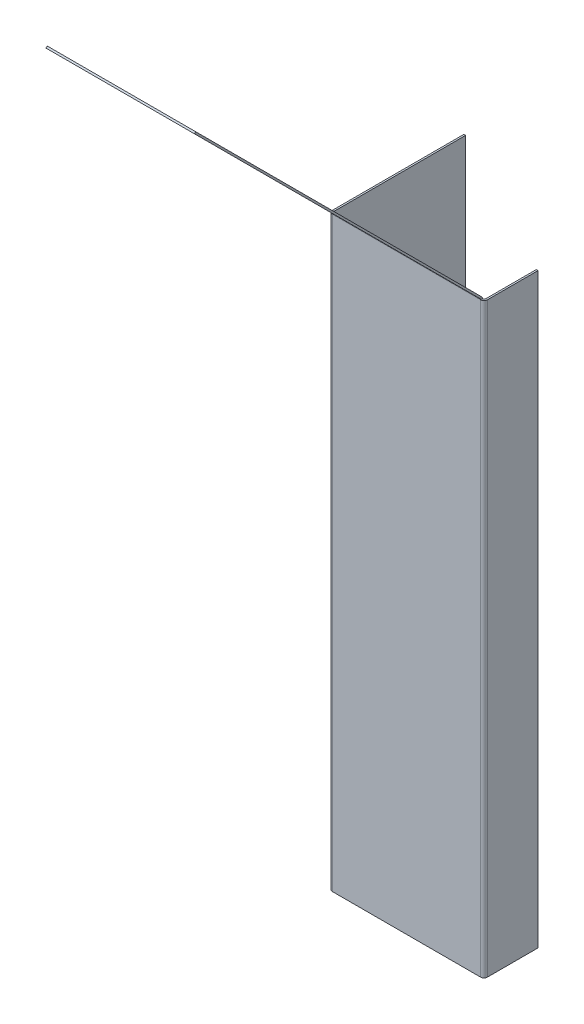
ISO-10303-21;
HEADER;
FILE_DESCRIPTION(('STEP AP214'),'2;1');
FILE_NAME('part.step','',(''),(''),'','','');
FILE_SCHEMA(('AUTOMOTIVE_DESIGN { 1 0 10303 214 1 1 1 1 }'));
ENDSEC;
DATA;
#1=APPLICATION_CONTEXT('core data for automotive mechanical design processes');
#2=APPLICATION_PROTOCOL_DEFINITION('international standard','automotive_design',2000,#1);
#3=PRODUCT_CONTEXT('',#1,'mechanical');
#4=PRODUCT('Part','Part','',(#3));
#5=PRODUCT_RELATED_PRODUCT_CATEGORY('part','',(#4));
#6=PRODUCT_DEFINITION_FORMATION('','',#4);
#7=PRODUCT_DEFINITION_CONTEXT('part definition',#1,'design');
#8=PRODUCT_DEFINITION('design','',#6,#7);
#9=PRODUCT_DEFINITION_SHAPE('','',#8);
#10=(LENGTH_UNIT() NAMED_UNIT(*) SI_UNIT(.MILLI.,.METRE.));
#11=(NAMED_UNIT(*) PLANE_ANGLE_UNIT() SI_UNIT($,.RADIAN.));
#12=(NAMED_UNIT(*) SI_UNIT($,.STERADIAN.) SOLID_ANGLE_UNIT());
#13=UNCERTAINTY_MEASURE_WITH_UNIT(LENGTH_MEASURE(1.E-05),#10,'distance_accuracy_value','');
#14=(GEOMETRIC_REPRESENTATION_CONTEXT(3) GLOBAL_UNCERTAINTY_ASSIGNED_CONTEXT((#13)) GLOBAL_UNIT_ASSIGNED_CONTEXT((#10,
#11,#12)) REPRESENTATION_CONTEXT('',''));
#15=CARTESIAN_POINT('',(0.,0.,0.));
#16=DIRECTION('',(0.,0.,1.));
#17=DIRECTION('',(1.,0.,0.));
#18=AXIS2_PLACEMENT_3D('',#15,#16,#17);
#19=CARTESIAN_POINT('',(-1.54940000000022,0.,-63.5));
#20=DIRECTION('',(0.,0.,1.));
#21=DIRECTION('',(1.,0.,0.));
#22=AXIS2_PLACEMENT_3D('',#19,#20,#21);
#23=PLANE('',#22);
#24=DIRECTION('',(0.,1.,0.));
#25=VECTOR('',#24,1.);
#26=CARTESIAN_POINT('',(-0.736600000000216,0.,-63.5));
#27=LINE('',#26,#25);
#28=CARTESIAN_POINT('',(-0.736600000000216,276.046890289956,-63.5));
#29=VERTEX_POINT('',#28);
#30=CARTESIAN_POINT('',(-0.736600000000216,130.175,-63.5));
#31=VERTEX_POINT('',#30);
#32=EDGE_CURVE('E325',#29,#31,#27,.F.);
#33=ORIENTED_EDGE('',*,*,#32,.T.);
#34=DIRECTION('',(-1.,0.,0.));
#35=VECTOR('',#34,1.);
#36=CARTESIAN_POINT('',(71.4004000000001,130.175,-63.5000000000002));
#37=LINE('',#36,#35);
#38=CARTESIAN_POINT('',(-1.54940000000022,130.175,-63.5));
#39=VERTEX_POINT('',#38);
#40=EDGE_CURVE('E344',#31,#39,#37,.T.);
#41=ORIENTED_EDGE('',*,*,#40,.T.);
#42=DIRECTION('',(0.,-1.,0.));
#43=VECTOR('',#42,1.);
#44=CARTESIAN_POINT('',(-1.54940000000022,0.,-63.5));
#45=LINE('',#44,#43);
#46=CARTESIAN_POINT('',(-1.54940000000022,276.046890289956,-63.5));
#47=VERTEX_POINT('',#46);
#48=EDGE_CURVE('E335',#47,#39,#45,.T.);
#49=ORIENTED_EDGE('',*,*,#48,.F.);
#50=DIRECTION('',(1.,0.,0.));
#51=VECTOR('',#50,1.);
#52=CARTESIAN_POINT('',(-1.54940000000022,276.046890289956,-63.5));
#53=LINE('',#52,#51);
#54=EDGE_CURVE('E298',#47,#29,#53,.T.);
#55=ORIENTED_EDGE('',*,*,#54,.T.);
#56=EDGE_LOOP('',(#33,#41,#49,#55));
#57=FACE_BOUND('',#56,.T.);
#58=ADVANCED_FACE('F79',(#57),#23,.F.);
#59=CARTESIAN_POINT('',(69.85,276.567745144978,0.215745144978014));
#60=DIRECTION('',(1.,0.,0.));
#61=DIRECTION('',(0.,0.,-1.));
#62=AXIS2_PLACEMENT_3D('',#59,#60,#61);
#63=PLANE('',#62);
#64=DIRECTION('',(0.,0.707106781186553,-0.707106781186542));
#65=VECTOR('',#64,1.);
#66=CARTESIAN_POINT('',(69.85,276.567745144978,0.215745144978014));
#67=LINE('',#66,#65);
#68=CARTESIAN_POINT('',(69.85,276.567745144978,0.215745144978014));
#69=VERTEX_POINT('',#68);
#70=CARTESIAN_POINT('',(69.85,277.142481536726,-0.358991246770408));
#71=VERTEX_POINT('',#70);
#72=EDGE_CURVE('E13',#69,#71,#67,.T.);
#73=ORIENTED_EDGE('',*,*,#72,.F.);
#74=CARTESIAN_POINT('',(69.85,276.046890289956,0.736600000000009));
#75=DIRECTION('',(-1.,0.,0.));
#76=DIRECTION('',(0.,0.,1.));
#77=AXIS2_PLACEMENT_3D('',#74,#75,#76);
#78=CIRCLE('',#77,0.7366);
#79=CARTESIAN_POINT('',(69.85,276.046890289956,0.));
#80=VERTEX_POINT('',#79);
#81=EDGE_CURVE('E150',#80,#69,#78,.F.);
#82=ORIENTED_EDGE('',*,*,#81,.F.);
#83=DIRECTION('',(0.,0.,1.));
#84=VECTOR('',#83,1.);
#85=CARTESIAN_POINT('',(69.85,276.046890289956,-0.812799999999991));
#86=LINE('',#85,#84);
#87=CARTESIAN_POINT('',(69.85,276.046890289956,-0.812799999999978));
#88=VERTEX_POINT('',#87);
#89=EDGE_CURVE('E87',#88,#80,#86,.T.);
#90=ORIENTED_EDGE('',*,*,#89,.F.);
#91=CARTESIAN_POINT('',(69.85,276.046890289956,0.736600000000009));
#92=DIRECTION('',(1.,0.,0.));
#93=DIRECTION('',(0.,0.,-1.));
#94=AXIS2_PLACEMENT_3D('',#91,#92,#93);
#95=CIRCLE('',#94,1.5494);
#96=EDGE_CURVE('E153',#88,#71,#95,.T.);
#97=ORIENTED_EDGE('',*,*,#96,.T.);
#98=EDGE_LOOP('',(#73,#82,#90,#97));
#99=FACE_BOUND('',#98,.T.);
#100=ADVANCED_FACE('F81',(#99),#63,.T.);
#101=CARTESIAN_POINT('',(69.85,276.046890289956,-0.812799999999991));
#102=DIRECTION('',(1.,0.,0.));
#103=DIRECTION('',(0.,0.,-1.));
#104=AXIS2_PLACEMENT_3D('',#101,#102,#103);
#105=PLANE('',#104);
#106=DIRECTION('',(0.,0.707106781186546,0.707106781186549));
#107=VECTOR('',#106,1.);
#108=CARTESIAN_POINT('',(69.85,276.352,0.));
#109=LINE('',#108,#107);
#110=CARTESIAN_POINT('',(69.85,411.055841816037,134.703841816038));
#111=VERTEX_POINT('',#110);
#112=EDGE_CURVE('E161',#69,#111,#109,.T.);
#113=ORIENTED_EDGE('',*,*,#112,.F.);
#114=ORIENTED_EDGE('',*,*,#72,.T.);
#115=DIRECTION('',(0.,0.707106781186546,0.707106781186549));
#116=VECTOR('',#115,1.);
#117=CARTESIAN_POINT('',(69.85,276.926736391748,-0.574736391748425));
#118=LINE('',#117,#116);
#119=CARTESIAN_POINT('',(69.85,411.630578207786,134.129105424289));
#120=VERTEX_POINT('',#119);
#121=EDGE_CURVE('E138',#71,#120,#118,.T.);
#122=ORIENTED_EDGE('',*,*,#121,.T.);
#123=DIRECTION('',(0.,0.707106781186548,-0.707106781186548));
#124=VECTOR('',#123,1.);
#125=CARTESIAN_POINT('',(69.85,411.055841816037,134.703841816038));
#126=LINE('',#125,#124);
#127=EDGE_CURVE('E171',#111,#120,#126,.T.);
#128=ORIENTED_EDGE('',*,*,#127,.F.);
#129=EDGE_LOOP('',(#113,#114,#122,#128));
#130=FACE_BOUND('',#129,.T.);
#131=ADVANCED_FACE('F169',(#130),#105,.T.);
#132=CARTESIAN_POINT('',(0.,276.046890289956,0.));
#133=DIRECTION('',(-1.,0.,0.));
#134=DIRECTION('',(0.,0.,1.));
#135=AXIS2_PLACEMENT_3D('',#132,#133,#134);
#136=PLANE('',#135);
#137=DIRECTION('',(0.,0.,-1.));
#138=VECTOR('',#137,1.);
#139=CARTESIAN_POINT('',(0.,276.046890289956,0.));
#140=LINE('',#139,#138);
#141=CARTESIAN_POINT('',(0.,276.046890289956,0.));
#142=VERTEX_POINT('',#141);
#143=CARTESIAN_POINT('',(0.,276.046890289956,-0.812799999999991));
#144=VERTEX_POINT('',#143);
#145=EDGE_CURVE('E223',#142,#144,#140,.T.);
#146=ORIENTED_EDGE('',*,*,#145,.F.);
#147=CARTESIAN_POINT('',(0.,276.046890289956,0.736600000000009));
#148=DIRECTION('',(-1.,0.,0.));
#149=DIRECTION('',(0.,0.,1.));
#150=AXIS2_PLACEMENT_3D('',#147,#148,#149);
#151=CIRCLE('',#150,0.7366);
#152=CARTESIAN_POINT('',(0.,276.567745144978,0.215745144978014));
#153=VERTEX_POINT('',#152);
#154=EDGE_CURVE('E197',#142,#153,#151,.F.);
#155=ORIENTED_EDGE('',*,*,#154,.T.);
#156=DIRECTION('',(0.,-0.707106781186553,0.707106781186542));
#157=VECTOR('',#156,1.);
#158=CARTESIAN_POINT('',(0.,277.142481536726,-0.358991246770408));
#159=LINE('',#158,#157);
#160=CARTESIAN_POINT('',(0.,277.142481536726,-0.358991246770408));
#161=VERTEX_POINT('',#160);
#162=EDGE_CURVE('E132',#161,#153,#159,.T.);
#163=ORIENTED_EDGE('',*,*,#162,.F.);
#164=CARTESIAN_POINT('',(0.,276.046890289956,0.736600000000009));
#165=DIRECTION('',(1.,0.,0.));
#166=DIRECTION('',(0.,0.,-1.));
#167=AXIS2_PLACEMENT_3D('',#164,#165,#166);
#168=CIRCLE('',#167,1.5494);
#169=EDGE_CURVE('E207',#144,#161,#168,.T.);
#170=ORIENTED_EDGE('',*,*,#169,.F.);
#171=EDGE_LOOP('',(#146,#155,#163,#170));
#172=FACE_BOUND('',#171,.T.);
#173=ADVANCED_FACE('F573',(#172),#136,.T.);
#174=CARTESIAN_POINT('',(69.85,276.926736391748,-0.574736391748425));
#175=DIRECTION('',(0.,-0.707106781186549,0.707106781186546));
#176=DIRECTION('',(0.,-0.707106781186546,-0.707106781186549));
#177=AXIS2_PLACEMENT_3D('',#174,#175,#176);
#178=PLANE('',#177);
#179=DIRECTION('',(0.,0.707106781186546,0.707106781186549));
#180=VECTOR('',#179,1.);
#181=CARTESIAN_POINT('',(0.,276.926736391748,-0.574736391748425));
#182=LINE('',#181,#180);
#183=CARTESIAN_POINT('',(0.,411.630578207786,134.129105424289));
#184=VERTEX_POINT('',#183);
#185=EDGE_CURVE('E189',#161,#184,#182,.T.);
#186=ORIENTED_EDGE('',*,*,#185,.T.);
#187=DIRECTION('',(-1.,0.,0.));
#188=VECTOR('',#187,1.);
#189=CARTESIAN_POINT('',(69.85,411.630578207786,134.129105424289));
#190=LINE('',#189,#188);
#191=EDGE_CURVE('E220',#120,#184,#190,.T.);
#192=ORIENTED_EDGE('',*,*,#191,.F.);
#193=ORIENTED_EDGE('',*,*,#121,.F.);
#194=DIRECTION('',(-1.,0.,0.));
#195=VECTOR('',#194,1.);
#196=CARTESIAN_POINT('',(69.85,277.142481536726,-0.358991246770408));
#197=LINE('',#196,#195);
#198=EDGE_CURVE('E188',#71,#161,#197,.T.);
#199=ORIENTED_EDGE('',*,*,#198,.T.);
#200=EDGE_LOOP('',(#186,#192,#193,#199));
#201=FACE_BOUND('',#200,.T.);
#202=ADVANCED_FACE('F247',(#201),#178,.F.);
#203=CARTESIAN_POINT('',(69.85,411.055841816037,134.703841816038));
#204=DIRECTION('',(0.,0.707106781186548,0.707106781186548));
#205=DIRECTION('',(0.,-0.707106781186548,0.707106781186548));
#206=AXIS2_PLACEMENT_3D('',#203,#204,#205);
#207=PLANE('',#206);
#208=DIRECTION('',(0.,0.707106781186548,-0.707106781186548));
#209=VECTOR('',#208,1.);
#210=CARTESIAN_POINT('',(0.,411.055841816037,134.703841816038));
#211=LINE('',#210,#209);
#212=CARTESIAN_POINT('',(0.,411.055841816037,134.703841816038));
#213=VERTEX_POINT('',#212);
#214=EDGE_CURVE('E192',#213,#184,#211,.T.);
#215=ORIENTED_EDGE('',*,*,#214,.F.);
#216=DIRECTION('',(-1.,0.,0.));
#217=VECTOR('',#216,1.);
#218=CARTESIAN_POINT('',(69.85,411.055841816037,134.703841816038));
#219=LINE('',#218,#217);
#220=EDGE_CURVE('E166',#111,#213,#219,.T.);
#221=ORIENTED_EDGE('',*,*,#220,.F.);
#222=ORIENTED_EDGE('',*,*,#127,.T.);
#223=ORIENTED_EDGE('',*,*,#191,.T.);
#224=EDGE_LOOP('',(#215,#221,#222,#223));
#225=FACE_BOUND('',#224,.T.);
#226=ADVANCED_FACE('F567',(#225),#207,.T.);
#227=CARTESIAN_POINT('',(69.85,276.352,0.));
#228=DIRECTION('',(0.,-0.707106781186549,0.707106781186546));
#229=DIRECTION('',(0.,-0.707106781186546,-0.707106781186549));
#230=AXIS2_PLACEMENT_3D('',#227,#228,#229);
#231=PLANE('',#230);
#232=DIRECTION('',(0.,0.707106781186546,0.707106781186549));
#233=VECTOR('',#232,1.);
#234=CARTESIAN_POINT('',(0.,276.352,0.));
#235=LINE('',#234,#233);
#236=EDGE_CURVE('E163',#153,#213,#235,.T.);
#237=ORIENTED_EDGE('',*,*,#236,.F.);
#238=DIRECTION('',(-1.,0.,0.));
#239=VECTOR('',#238,1.);
#240=CARTESIAN_POINT('',(69.85,276.567745144978,0.215745144978014));
#241=LINE('',#240,#239);
#242=EDGE_CURVE('E159',#69,#153,#241,.T.);
#243=ORIENTED_EDGE('',*,*,#242,.F.);
#244=ORIENTED_EDGE('',*,*,#112,.T.);
#245=ORIENTED_EDGE('',*,*,#220,.T.);
#246=EDGE_LOOP('',(#237,#243,#244,#245));
#247=FACE_BOUND('',#246,.T.);
#248=ADVANCED_FACE('F160',(#247),#231,.T.);
#249=CARTESIAN_POINT('',(69.85,276.046890289956,0.736600000000009));
#250=DIRECTION('',(-1.,0.,0.));
#251=DIRECTION('',(0.,0.,1.));
#252=AXIS2_PLACEMENT_3D('',#249,#250,#251);
#253=CYLINDRICAL_SURFACE('',#252,0.7366);
#254=ORIENTED_EDGE('',*,*,#154,.F.);
#255=DIRECTION('',(-1.,0.,0.));
#256=VECTOR('',#255,1.);
#257=CARTESIAN_POINT('',(69.85,276.046890289956,0.));
#258=LINE('',#257,#256);
#259=EDGE_CURVE('E167',#80,#142,#258,.T.);
#260=ORIENTED_EDGE('',*,*,#259,.F.);
#261=ORIENTED_EDGE('',*,*,#81,.T.);
#262=ORIENTED_EDGE('',*,*,#242,.T.);
#263=EDGE_LOOP('',(#254,#260,#261,#262));
#264=FACE_BOUND('',#263,.T.);
#265=ADVANCED_FACE('F174',(#264),#253,.F.);
#266=CARTESIAN_POINT('',(69.85,0.,0.));
#267=DIRECTION('',(0.,0.,1.));
#268=DIRECTION('',(1.,0.,0.));
#269=AXIS2_PLACEMENT_3D('',#266,#267,#268);
#270=PLANE('',#269);
#271=DIRECTION('',(0.,1.,0.));
#272=VECTOR('',#271,1.);
#273=CARTESIAN_POINT('',(0.,0.,0.));
#274=LINE('',#273,#272);
#275=CARTESIAN_POINT('',(0.,0.,0.));
#276=VERTEX_POINT('',#275);
#277=EDGE_CURVE('E199',#276,#142,#274,.T.);
#278=ORIENTED_EDGE('',*,*,#277,.F.);
#279=DIRECTION('',(-1.,0.,0.));
#280=VECTOR('',#279,1.);
#281=CARTESIAN_POINT('',(69.85,0.,0.));
#282=LINE('',#281,#280);
#283=CARTESIAN_POINT('',(69.85,0.,0.));
#284=VERTEX_POINT('',#283);
#285=EDGE_CURVE('E216',#284,#276,#282,.T.);
#286=ORIENTED_EDGE('',*,*,#285,.F.);
#287=DIRECTION('',(0.,1.,0.));
#288=VECTOR('',#287,1.);
#289=CARTESIAN_POINT('',(69.85,0.,0.));
#290=LINE('',#289,#288);
#291=EDGE_CURVE('E176',#284,#80,#290,.T.);
#292=ORIENTED_EDGE('',*,*,#291,.T.);
#293=ORIENTED_EDGE('',*,*,#259,.T.);
#294=EDGE_LOOP('',(#278,#286,#292,#293));
#295=FACE_BOUND('',#294,.T.);
#296=ADVANCED_FACE('F468',(#295),#270,.T.);
#297=CARTESIAN_POINT('',(69.85,0.,-0.8128));
#298=DIRECTION('',(0.,-1.,0.));
#299=DIRECTION('',(0.,0.,-1.));
#300=AXIS2_PLACEMENT_3D('',#297,#298,#299);
#301=PLANE('',#300);
#302=DIRECTION('',(0.,0.,1.));
#303=VECTOR('',#302,1.);
#304=CARTESIAN_POINT('',(0.,0.,-0.8128));
#305=LINE('',#304,#303);
#306=CARTESIAN_POINT('',(0.,0.,-0.8128));
#307=VERTEX_POINT('',#306);
#308=EDGE_CURVE('E202',#307,#276,#305,.T.);
#309=ORIENTED_EDGE('',*,*,#308,.F.);
#310=DIRECTION('',(-1.,0.,0.));
#311=VECTOR('',#310,1.);
#312=CARTESIAN_POINT('',(69.85,0.,-0.8128));
#313=LINE('',#312,#311);
#314=CARTESIAN_POINT('',(69.85,0.,-0.812800000000018));
#315=VERTEX_POINT('',#314);
#316=EDGE_CURVE('E214',#315,#307,#313,.T.);
#317=ORIENTED_EDGE('',*,*,#316,.F.);
#318=DIRECTION('',(0.,0.,1.));
#319=VECTOR('',#318,1.);
#320=CARTESIAN_POINT('',(69.85,0.,-0.8128));
#321=LINE('',#320,#319);
#322=EDGE_CURVE('E178',#315,#284,#321,.T.);
#323=ORIENTED_EDGE('',*,*,#322,.T.);
#324=ORIENTED_EDGE('',*,*,#285,.T.);
#325=EDGE_LOOP('',(#309,#317,#323,#324));
#326=FACE_BOUND('',#325,.T.);
#327=ADVANCED_FACE('F471',(#326),#301,.T.);
#328=CARTESIAN_POINT('',(69.85,0.,-0.8128));
#329=DIRECTION('',(0.,0.,1.));
#330=DIRECTION('',(1.,0.,0.));
#331=AXIS2_PLACEMENT_3D('',#328,#329,#330);
#332=PLANE('',#331);
#333=DIRECTION('',(0.,1.,0.));
#334=VECTOR('',#333,1.);
#335=CARTESIAN_POINT('',(0.,0.,-0.8128));
#336=LINE('',#335,#334);
#337=EDGE_CURVE('E205',#307,#144,#336,.T.);
#338=ORIENTED_EDGE('',*,*,#337,.T.);
#339=DIRECTION('',(-1.,0.,0.));
#340=VECTOR('',#339,1.);
#341=CARTESIAN_POINT('',(69.85,276.046890289956,-0.812799999999991));
#342=LINE('',#341,#340);
#343=EDGE_CURVE('E211',#88,#144,#342,.T.);
#344=ORIENTED_EDGE('',*,*,#343,.F.);
#345=DIRECTION('',(0.,1.,0.));
#346=VECTOR('',#345,1.);
#347=CARTESIAN_POINT('',(69.85,0.,-0.8128));
#348=LINE('',#347,#346);
#349=EDGE_CURVE('E184',#315,#88,#348,.T.);
#350=ORIENTED_EDGE('',*,*,#349,.F.);
#351=ORIENTED_EDGE('',*,*,#316,.T.);
#352=EDGE_LOOP('',(#338,#344,#350,#351));
#353=FACE_BOUND('',#352,.T.);
#354=ADVANCED_FACE('F241',(#353),#332,.F.);
#355=CARTESIAN_POINT('',(69.85,276.046890289956,0.736600000000009));
#356=DIRECTION('',(-1.,0.,0.));
#357=DIRECTION('',(0.,0.,1.));
#358=AXIS2_PLACEMENT_3D('',#355,#356,#357);
#359=CYLINDRICAL_SURFACE('',#358,1.5494);
#360=ORIENTED_EDGE('',*,*,#169,.T.);
#361=ORIENTED_EDGE('',*,*,#198,.F.);
#362=ORIENTED_EDGE('',*,*,#96,.F.);
#363=ORIENTED_EDGE('',*,*,#343,.T.);
#364=EDGE_LOOP('',(#360,#361,#362,#363));
#365=FACE_BOUND('',#364,.T.);
#366=ADVANCED_FACE('F244',(#365),#359,.T.);
#367=CARTESIAN_POINT('',(0.,276.046890289956,0.736600000000009));
#368=DIRECTION('',(-1.,0.,0.));
#369=DIRECTION('',(0.,0.,1.));
#370=AXIS2_PLACEMENT_3D('',#367,#368,#369);
#371=PLANE('',#370);
#372=ORIENTED_EDGE('',*,*,#185,.F.);
#373=ORIENTED_EDGE('',*,*,#162,.T.);
#374=ORIENTED_EDGE('',*,*,#236,.T.);
#375=ORIENTED_EDGE('',*,*,#214,.T.);
#376=EDGE_LOOP('',(#372,#373,#374,#375));
#377=FACE_BOUND('',#376,.T.);
#378=ADVANCED_FACE('F549',(#377),#371,.T.);
#379=CARTESIAN_POINT('',(69.85,276.046890289956,-1.54939999999998));
#380=DIRECTION('',(0.,1.,0.));
#381=DIRECTION('',(0.,0.,1.));
#382=AXIS2_PLACEMENT_3D('',#379,#380,#381);
#383=PLANE('',#382);
#384=DIRECTION('',(-1.,0.,0.));
#385=VECTOR('',#384,1.);
#386=CARTESIAN_POINT('',(71.3994,276.046890289956,-1.54939999999999));
#387=LINE('',#386,#385);
#388=CARTESIAN_POINT('',(70.5866,276.046890289956,-1.54939999999998));
#389=VERTEX_POINT('',#388);
#390=CARTESIAN_POINT('',(71.3994,276.046890289956,-1.54939999999998));
#391=VERTEX_POINT('',#390);
#392=EDGE_CURVE('E259',#389,#391,#387,.F.);
#393=ORIENTED_EDGE('',*,*,#392,.F.);
#394=CARTESIAN_POINT('',(69.85,276.046890289956,-1.54939999999998));
#395=DIRECTION('',(0.,-1.,0.));
#396=DIRECTION('',(0.,0.,-1.));
#397=AXIS2_PLACEMENT_3D('',#394,#395,#396);
#398=CIRCLE('',#397,0.736600000000004);
#399=EDGE_CURVE('E235',#88,#389,#398,.F.);
#400=ORIENTED_EDGE('',*,*,#399,.F.);
#401=ORIENTED_EDGE('',*,*,#89,.T.);
#402=CARTESIAN_POINT('',(69.85,276.046890289956,-1.54939999999998));
#403=DIRECTION('',(0.,-1.,0.));
#404=DIRECTION('',(0.,0.,-1.));
#405=AXIS2_PLACEMENT_3D('',#402,#403,#404);
#406=CIRCLE('',#405,1.5494);
#407=EDGE_CURVE('E193',#80,#391,#406,.F.);
#408=ORIENTED_EDGE('',*,*,#407,.T.);
#409=EDGE_LOOP('',(#393,#400,#401,#408));
#410=FACE_BOUND('',#409,.T.);
#411=ADVANCED_FACE('F230',(#410),#383,.T.);
#412=CARTESIAN_POINT('',(69.85,0.,-1.54940000000002));
#413=DIRECTION('',(0.,1.,0.));
#414=DIRECTION('',(0.,0.,1.));
#415=AXIS2_PLACEMENT_3D('',#412,#413,#414);
#416=PLANE('',#415);
#417=CARTESIAN_POINT('',(69.85,0.,-1.54940000000002));
#418=DIRECTION('',(0.,-1.,0.));
#419=DIRECTION('',(0.,0.,-1.));
#420=AXIS2_PLACEMENT_3D('',#417,#418,#419);
#421=CIRCLE('',#420,0.736600000000004);
#422=CARTESIAN_POINT('',(70.5866,0.,-1.54940000000002));
#423=VERTEX_POINT('',#422);
#424=EDGE_CURVE('E250',#423,#315,#421,.T.);
#425=ORIENTED_EDGE('',*,*,#424,.F.);
#426=DIRECTION('',(-1.,0.,0.));
#427=VECTOR('',#426,1.);
#428=CARTESIAN_POINT('',(70.5866,0.,-1.54940000000001));
#429=LINE('',#428,#427);
#430=CARTESIAN_POINT('',(71.3994,0.,-1.5494));
#431=VERTEX_POINT('',#430);
#432=EDGE_CURVE('E265',#423,#431,#429,.F.);
#433=ORIENTED_EDGE('',*,*,#432,.T.);
#434=CARTESIAN_POINT('',(69.85,0.,-1.54940000000002));
#435=DIRECTION('',(0.,-1.,0.));
#436=DIRECTION('',(0.,0.,-1.));
#437=AXIS2_PLACEMENT_3D('',#434,#435,#436);
#438=CIRCLE('',#437,1.5494);
#439=EDGE_CURVE('E255',#431,#284,#438,.T.);
#440=ORIENTED_EDGE('',*,*,#439,.T.);
#441=ORIENTED_EDGE('',*,*,#322,.F.);
#442=EDGE_LOOP('',(#425,#433,#440,#441));
#443=FACE_BOUND('',#442,.T.);
#444=ADVANCED_FACE('F448',(#443),#416,.F.);
#445=CARTESIAN_POINT('',(69.85,0.,-1.54940000000002));
#446=DIRECTION('',(0.,-1.,0.));
#447=DIRECTION('',(1.,0.,0.));
#448=AXIS2_PLACEMENT_3D('',#445,#446,#447);
#449=CYLINDRICAL_SURFACE('',#448,1.5494);
#450=ORIENTED_EDGE('',*,*,#291,.F.);
#451=ORIENTED_EDGE('',*,*,#439,.F.);
#452=DIRECTION('',(0.,-1.,0.));
#453=VECTOR('',#452,1.);
#454=CARTESIAN_POINT('',(71.3994,276.046890289956,-1.54939999999999));
#455=LINE('',#454,#453);
#456=EDGE_CURVE('E268',#431,#391,#455,.F.);
#457=ORIENTED_EDGE('',*,*,#456,.T.);
#458=ORIENTED_EDGE('',*,*,#407,.F.);
#459=EDGE_LOOP('',(#450,#451,#457,#458));
#460=FACE_BOUND('',#459,.T.);
#461=ADVANCED_FACE('F464',(#460),#449,.T.);
#462=CARTESIAN_POINT('',(69.85,0.,-1.54940000000002));
#463=DIRECTION('',(0.,-1.,0.));
#464=DIRECTION('',(1.,0.,0.));
#465=AXIS2_PLACEMENT_3D('',#462,#463,#464);
#466=CYLINDRICAL_SURFACE('',#465,0.736600000000004);
#467=ORIENTED_EDGE('',*,*,#349,.T.);
#468=ORIENTED_EDGE('',*,*,#399,.T.);
#469=DIRECTION('',(0.,-1.,0.));
#470=VECTOR('',#469,1.);
#471=CARTESIAN_POINT('',(70.5866,276.046890289956,-1.54939999999999));
#472=LINE('',#471,#470);
#473=EDGE_CURVE('E261',#389,#423,#472,.T.);
#474=ORIENTED_EDGE('',*,*,#473,.T.);
#475=ORIENTED_EDGE('',*,*,#424,.T.);
#476=EDGE_LOOP('',(#467,#468,#474,#475));
#477=FACE_BOUND('',#476,.T.);
#478=ADVANCED_FACE('F441',(#477),#466,.F.);
#479=CARTESIAN_POINT('',(71.3994000000001,0.,-25.4));
#480=DIRECTION('',(0.,1.,0.));
#481=DIRECTION('',(0.,0.,1.));
#482=AXIS2_PLACEMENT_3D('',#479,#480,#481);
#483=PLANE('',#482);
#484=ORIENTED_EDGE('',*,*,#432,.F.);
#485=DIRECTION('',(0.,0.,1.));
#486=VECTOR('',#485,1.);
#487=CARTESIAN_POINT('',(70.5866000000001,0.,-25.4));
#488=LINE('',#487,#486);
#489=CARTESIAN_POINT('',(70.5866000000001,0.,-25.4));
#490=VERTEX_POINT('',#489);
#491=EDGE_CURVE('E271',#423,#490,#488,.F.);
#492=ORIENTED_EDGE('',*,*,#491,.T.);
#493=DIRECTION('',(-1.,0.,0.));
#494=VECTOR('',#493,1.);
#495=CARTESIAN_POINT('',(71.3994000000001,0.,-25.4));
#496=LINE('',#495,#494);
#497=CARTESIAN_POINT('',(71.3994000000001,0.,-25.4));
#498=VERTEX_POINT('',#497);
#499=EDGE_CURVE('E253',#498,#490,#496,.T.);
#500=ORIENTED_EDGE('',*,*,#499,.F.);
#501=DIRECTION('',(0.,0.,-1.));
#502=VECTOR('',#501,1.);
#503=CARTESIAN_POINT('',(71.3994,0.,2.39391077301776E-13));
#504=LINE('',#503,#502);
#505=EDGE_CURVE('E280',#431,#498,#504,.T.);
#506=ORIENTED_EDGE('',*,*,#505,.F.);
#507=EDGE_LOOP('',(#484,#492,#500,#506));
#508=FACE_BOUND('',#507,.T.);
#509=ADVANCED_FACE('F452',(#508),#483,.F.);
#510=CARTESIAN_POINT('',(71.3994,276.046890289956,-0.812799999999988));
#511=DIRECTION('',(0.,-1.,0.));
#512=DIRECTION('',(1.,0.,0.));
#513=AXIS2_PLACEMENT_3D('',#510,#511,#512);
#514=PLANE('',#513);
#515=ORIENTED_EDGE('',*,*,#392,.T.);
#516=DIRECTION('',(0.,0.,1.));
#517=VECTOR('',#516,1.);
#518=CARTESIAN_POINT('',(71.3994,276.046890289956,2.39391077301776E-13));
#519=LINE('',#518,#517);
#520=CARTESIAN_POINT('',(71.3994000000001,276.046890289956,-25.4));
#521=VERTEX_POINT('',#520);
#522=EDGE_CURVE('E286',#521,#391,#519,.T.);
#523=ORIENTED_EDGE('',*,*,#522,.F.);
#524=DIRECTION('',(-1.,0.,0.));
#525=VECTOR('',#524,1.);
#526=CARTESIAN_POINT('',(71.3994000000001,276.046890289956,-25.4));
#527=LINE('',#526,#525);
#528=CARTESIAN_POINT('',(70.5866000000001,276.046890289956,-25.4));
#529=VERTEX_POINT('',#528);
#530=EDGE_CURVE('E289',#521,#529,#527,.T.);
#531=ORIENTED_EDGE('',*,*,#530,.T.);
#532=DIRECTION('',(0.,0.,-1.));
#533=VECTOR('',#532,1.);
#534=CARTESIAN_POINT('',(70.5866,276.046890289956,-0.812799999999991));
#535=LINE('',#534,#533);
#536=EDGE_CURVE('E277',#529,#389,#535,.F.);
#537=ORIENTED_EDGE('',*,*,#536,.T.);
#538=EDGE_LOOP('',(#515,#523,#531,#537));
#539=FACE_BOUND('',#538,.T.);
#540=ADVANCED_FACE('F533',(#539),#514,.F.);
#541=CARTESIAN_POINT('',(71.3994,0.,2.39391077301776E-13));
#542=DIRECTION('',(-1.,0.,0.));
#543=DIRECTION('',(0.,0.,1.));
#544=AXIS2_PLACEMENT_3D('',#541,#542,#543);
#545=PLANE('',#544);
#546=ORIENTED_EDGE('',*,*,#456,.F.);
#547=ORIENTED_EDGE('',*,*,#505,.T.);
#548=DIRECTION('',(0.,1.,0.));
#549=VECTOR('',#548,1.);
#550=CARTESIAN_POINT('',(71.3994000000001,0.,-25.4));
#551=LINE('',#550,#549);
#552=EDGE_CURVE('E283',#498,#521,#551,.T.);
#553=ORIENTED_EDGE('',*,*,#552,.T.);
#554=ORIENTED_EDGE('',*,*,#522,.T.);
#555=EDGE_LOOP('',(#546,#547,#553,#554));
#556=FACE_BOUND('',#555,.T.);
#557=ADVANCED_FACE('F462',(#556),#545,.F.);
#558=CARTESIAN_POINT('',(70.5866,0.,2.36553201269565E-13));
#559=DIRECTION('',(-1.,0.,0.));
#560=DIRECTION('',(0.,0.,1.));
#561=AXIS2_PLACEMENT_3D('',#558,#559,#560);
#562=PLANE('',#561);
#563=ORIENTED_EDGE('',*,*,#491,.F.);
#564=ORIENTED_EDGE('',*,*,#473,.F.);
#565=ORIENTED_EDGE('',*,*,#536,.F.);
#566=DIRECTION('',(0.,-1.,0.));
#567=VECTOR('',#566,1.);
#568=CARTESIAN_POINT('',(70.5866000000001,276.046890289956,-25.4));
#569=LINE('',#568,#567);
#570=EDGE_CURVE('E274',#490,#529,#569,.F.);
#571=ORIENTED_EDGE('',*,*,#570,.F.);
#572=EDGE_LOOP('',(#563,#564,#565,#571));
#573=FACE_BOUND('',#572,.T.);
#574=ADVANCED_FACE('F455',(#573),#562,.T.);
#575=CARTESIAN_POINT('',(71.3994000000001,276.046890289956,-25.4));
#576=DIRECTION('',(0.,0.,1.));
#577=DIRECTION('',(1.,0.,0.));
#578=AXIS2_PLACEMENT_3D('',#575,#576,#577);
#579=PLANE('',#578);
#580=ORIENTED_EDGE('',*,*,#570,.T.);
#581=ORIENTED_EDGE('',*,*,#530,.F.);
#582=ORIENTED_EDGE('',*,*,#552,.F.);
#583=ORIENTED_EDGE('',*,*,#499,.T.);
#584=EDGE_LOOP('',(#580,#581,#582,#583));
#585=FACE_BOUND('',#584,.T.);
#586=ADVANCED_FACE('F459',(#585),#579,.F.);
#587=CARTESIAN_POINT('',(0.,0.,-1.54940000000002));
#588=DIRECTION('',(0.,-1.,0.));
#589=DIRECTION('',(0.,0.,-1.));
#590=AXIS2_PLACEMENT_3D('',#587,#588,#589);
#591=PLANE('',#590);
#592=DIRECTION('',(1.,0.,0.));
#593=VECTOR('',#592,1.);
#594=CARTESIAN_POINT('',(-1.5494,0.,-1.54939999999999));
#595=LINE('',#594,#593);
#596=CARTESIAN_POINT('',(-0.7366,0.,-1.54940000000001));
#597=VERTEX_POINT('',#596);
#598=CARTESIAN_POINT('',(-1.5494,0.,-1.54940000000001));
#599=VERTEX_POINT('',#598);
#600=EDGE_CURVE('E306',#597,#599,#595,.F.);
#601=ORIENTED_EDGE('',*,*,#600,.F.);
#602=CARTESIAN_POINT('',(0.,0.,-1.54940000000002));
#603=DIRECTION('',(0.,1.,0.));
#604=DIRECTION('',(0.,0.,1.));
#605=AXIS2_PLACEMENT_3D('',#602,#603,#604);
#606=CIRCLE('',#605,0.73659999999999);
#607=EDGE_CURVE('E297',#307,#597,#606,.F.);
#608=ORIENTED_EDGE('',*,*,#607,.F.);
#609=ORIENTED_EDGE('',*,*,#308,.T.);
#610=CARTESIAN_POINT('',(0.,0.,-1.54940000000002));
#611=DIRECTION('',(0.,1.,0.));
#612=DIRECTION('',(0.,0.,1.));
#613=AXIS2_PLACEMENT_3D('',#610,#611,#612);
#614=CIRCLE('',#613,1.54939999999999);
#615=EDGE_CURVE('E262',#276,#599,#614,.F.);
#616=ORIENTED_EDGE('',*,*,#615,.T.);
#617=EDGE_LOOP('',(#601,#608,#609,#616));
#618=FACE_BOUND('',#617,.T.);
#619=ADVANCED_FACE('F479',(#618),#591,.T.);
#620=CARTESIAN_POINT('',(0.,276.046890289956,-1.54939999999998));
#621=DIRECTION('',(0.,-1.,0.));
#622=DIRECTION('',(0.,0.,-1.));
#623=AXIS2_PLACEMENT_3D('',#620,#621,#622);
#624=PLANE('',#623);
#625=CARTESIAN_POINT('',(0.,276.046890289956,-1.54939999999998));
#626=DIRECTION('',(0.,1.,0.));
#627=DIRECTION('',(0.,0.,1.));
#628=AXIS2_PLACEMENT_3D('',#625,#626,#627);
#629=CIRCLE('',#628,0.73659999999999);
#630=CARTESIAN_POINT('',(-0.73659999999998,276.046890289956,-1.54939999999997));
#631=VERTEX_POINT('',#630);
#632=EDGE_CURVE('E294',#631,#144,#629,.T.);
#633=ORIENTED_EDGE('',*,*,#632,.F.);
#634=DIRECTION('',(1.,0.,0.));
#635=VECTOR('',#634,1.);
#636=CARTESIAN_POINT('',(-0.7366,276.046890289956,-1.54939999999999));
#637=LINE('',#636,#635);
#638=CARTESIAN_POINT('',(-1.5494,276.046890289956,-1.54939999999999));
#639=VERTEX_POINT('',#638);
#640=EDGE_CURVE('E312',#631,#639,#637,.F.);
#641=ORIENTED_EDGE('',*,*,#640,.T.);
#642=CARTESIAN_POINT('',(0.,276.046890289956,-1.54939999999998));
#643=DIRECTION('',(0.,1.,0.));
#644=DIRECTION('',(0.,0.,1.));
#645=AXIS2_PLACEMENT_3D('',#642,#643,#644);
#646=CIRCLE('',#645,1.54939999999999);
#647=EDGE_CURVE('E301',#639,#142,#646,.T.);
#648=ORIENTED_EDGE('',*,*,#647,.T.);
#649=ORIENTED_EDGE('',*,*,#145,.T.);
#650=EDGE_LOOP('',(#633,#641,#648,#649));
#651=FACE_BOUND('',#650,.T.);
#652=ADVANCED_FACE('F492',(#651),#624,.F.);
#653=CARTESIAN_POINT('',(0.,276.046890289956,-1.54939999999998));
#654=DIRECTION('',(0.,1.,0.));
#655=DIRECTION('',(-1.,0.,0.));
#656=AXIS2_PLACEMENT_3D('',#653,#654,#655);
#657=CYLINDRICAL_SURFACE('',#656,1.54939999999999);
#658=ORIENTED_EDGE('',*,*,#277,.T.);
#659=ORIENTED_EDGE('',*,*,#647,.F.);
#660=DIRECTION('',(0.,1.,0.));
#661=VECTOR('',#660,1.);
#662=CARTESIAN_POINT('',(-1.5494,0.,-1.54939999999999));
#663=LINE('',#662,#661);
#664=EDGE_CURVE('E315',#639,#599,#663,.F.);
#665=ORIENTED_EDGE('',*,*,#664,.T.);
#666=ORIENTED_EDGE('',*,*,#615,.F.);
#667=EDGE_LOOP('',(#658,#659,#665,#666));
#668=FACE_BOUND('',#667,.T.);
#669=ADVANCED_FACE('F521',(#668),#657,.T.);
#670=CARTESIAN_POINT('',(0.,276.046890289956,-1.54939999999998));
#671=DIRECTION('',(0.,1.,0.));
#672=DIRECTION('',(-1.,0.,0.));
#673=AXIS2_PLACEMENT_3D('',#670,#671,#672);
#674=CYLINDRICAL_SURFACE('',#673,0.73659999999999);
#675=ORIENTED_EDGE('',*,*,#337,.F.);
#676=ORIENTED_EDGE('',*,*,#607,.T.);
#677=DIRECTION('',(0.,1.,0.));
#678=VECTOR('',#677,1.);
#679=CARTESIAN_POINT('',(-0.7366,0.,-1.5494));
#680=LINE('',#679,#678);
#681=EDGE_CURVE('E309',#597,#631,#680,.T.);
#682=ORIENTED_EDGE('',*,*,#681,.T.);
#683=ORIENTED_EDGE('',*,*,#632,.T.);
#684=EDGE_LOOP('',(#675,#676,#682,#683));
#685=FACE_BOUND('',#684,.T.);
#686=ADVANCED_FACE('F476',(#685),#674,.F.);
#687=CARTESIAN_POINT('',(-1.5494,0.,-0.812799999999997));
#688=DIRECTION('',(0.,1.,0.));
#689=DIRECTION('',(0.,0.,1.));
#690=AXIS2_PLACEMENT_3D('',#687,#688,#689);
#691=PLANE('',#690);
#692=ORIENTED_EDGE('',*,*,#600,.T.);
#693=DIRECTION('',(0.,0.,1.));
#694=VECTOR('',#693,1.);
#695=CARTESIAN_POINT('',(-1.54939999999999,0.,0.));
#696=LINE('',#695,#694);
#697=CARTESIAN_POINT('',(-1.54940000000022,0.,-63.5));
#698=VERTEX_POINT('',#697);
#699=EDGE_CURVE('E328',#698,#599,#696,.T.);
#700=ORIENTED_EDGE('',*,*,#699,.F.);
#701=DIRECTION('',(1.,0.,0.));
#702=VECTOR('',#701,1.);
#703=CARTESIAN_POINT('',(-1.54940000000022,0.,-63.5));
#704=LINE('',#703,#702);
#705=CARTESIAN_POINT('',(-0.736600000000216,0.,-63.5));
#706=VERTEX_POINT('',#705);
#707=EDGE_CURVE('E338',#698,#706,#704,.T.);
#708=ORIENTED_EDGE('',*,*,#707,.T.);
#709=DIRECTION('',(0.,0.,-1.));
#710=VECTOR('',#709,1.);
#711=CARTESIAN_POINT('',(-0.736599999999997,0.,-0.8128));
#712=LINE('',#711,#710);
#713=EDGE_CURVE('E318',#706,#597,#712,.F.);
#714=ORIENTED_EDGE('',*,*,#713,.T.);
#715=EDGE_LOOP('',(#692,#700,#708,#714));
#716=FACE_BOUND('',#715,.T.);
#717=ADVANCED_FACE('F482',(#716),#691,.F.);
#718=CARTESIAN_POINT('',(-1.54940000000022,276.046890289956,-63.5));
#719=DIRECTION('',(0.,-1.,0.));
#720=DIRECTION('',(1.,0.,0.));
#721=AXIS2_PLACEMENT_3D('',#718,#719,#720);
#722=PLANE('',#721);
#723=ORIENTED_EDGE('',*,*,#640,.F.);
#724=DIRECTION('',(0.,0.,1.));
#725=VECTOR('',#724,1.);
#726=CARTESIAN_POINT('',(-0.736600000000216,276.046890289956,-63.5));
#727=LINE('',#726,#725);
#728=EDGE_CURVE('E321',#631,#29,#727,.F.);
#729=ORIENTED_EDGE('',*,*,#728,.T.);
#730=ORIENTED_EDGE('',*,*,#54,.F.);
#731=DIRECTION('',(0.,0.,-1.));
#732=VECTOR('',#731,1.);
#733=CARTESIAN_POINT('',(-1.54939999999999,276.046890289956,0.));
#734=LINE('',#733,#732);
#735=EDGE_CURVE('E331',#639,#47,#734,.T.);
#736=ORIENTED_EDGE('',*,*,#735,.F.);
#737=EDGE_LOOP('',(#723,#729,#730,#736));
#738=FACE_BOUND('',#737,.T.);
#739=ADVANCED_FACE('F495',(#738),#722,.F.);
#740=CARTESIAN_POINT('',(-1.54939999999999,0.,0.));
#741=DIRECTION('',(1.,0.,0.));
#742=DIRECTION('',(0.,0.,-1.));
#743=AXIS2_PLACEMENT_3D('',#740,#741,#742);
#744=PLANE('',#743);
#745=ORIENTED_EDGE('',*,*,#48,.T.);
#746=DIRECTION('',(0.,0.,-1.));
#747=VECTOR('',#746,1.);
#748=CARTESIAN_POINT('',(-1.54940000000022,130.175,-63.5));
#749=LINE('',#748,#747);
#750=CARTESIAN_POINT('',(-1.54940000000019,130.175,-54.7601590881502));
#751=VERTEX_POINT('',#750);
#752=EDGE_CURVE('E348',#751,#39,#749,.T.);
#753=ORIENTED_EDGE('',*,*,#752,.F.);
#754=DIRECTION('',(0.,1.,0.));
#755=VECTOR('',#754,1.);
#756=CARTESIAN_POINT('',(-1.54940000000019,130.175,-54.7601590881502));
#757=LINE('',#756,#755);
#758=CARTESIAN_POINT('',(-1.54940000000019,53.9749999999998,-54.7601590881502));
#759=VERTEX_POINT('',#758);
#760=EDGE_CURVE('E358',#759,#751,#757,.T.);
#761=ORIENTED_EDGE('',*,*,#760,.F.);
#762=DIRECTION('',(0.,0.,1.));
#763=VECTOR('',#762,1.);
#764=CARTESIAN_POINT('',(-1.54940000000022,53.975,-63.5));
#765=LINE('',#764,#763);
#766=CARTESIAN_POINT('',(-1.54940000000022,53.975,-63.5));
#767=VERTEX_POINT('',#766);
#768=EDGE_CURVE('E361',#767,#759,#765,.T.);
#769=ORIENTED_EDGE('',*,*,#768,.F.);
#770=EDGE_CURVE('E334',#767,#698,#45,.T.);
#771=ORIENTED_EDGE('',*,*,#770,.T.);
#772=ORIENTED_EDGE('',*,*,#699,.T.);
#773=ORIENTED_EDGE('',*,*,#664,.F.);
#774=ORIENTED_EDGE('',*,*,#735,.T.);
#775=EDGE_LOOP('',(#745,#753,#761,#769,#771,#772,#773,#774));
#776=FACE_BOUND('',#775,.T.);
#777=ADVANCED_FACE('F396',(#776),#744,.F.);
#778=CARTESIAN_POINT('',(-0.736599999999995,0.,0.));
#779=DIRECTION('',(1.,0.,0.));
#780=DIRECTION('',(0.,0.,-1.));
#781=AXIS2_PLACEMENT_3D('',#778,#779,#780);
#782=PLANE('',#781);
#783=DIRECTION('',(0.,0.,-1.));
#784=VECTOR('',#783,1.);
#785=CARTESIAN_POINT('',(-0.736600000000212,130.175,-63.5));
#786=LINE('',#785,#784);
#787=CARTESIAN_POINT('',(-0.736600000000184,130.175,-54.7601590881502));
#788=VERTEX_POINT('',#787);
#789=EDGE_CURVE('E364',#788,#31,#786,.T.);
#790=ORIENTED_EDGE('',*,*,#789,.T.);
#791=ORIENTED_EDGE('',*,*,#32,.F.);
#792=ORIENTED_EDGE('',*,*,#728,.F.);
#793=ORIENTED_EDGE('',*,*,#681,.F.);
#794=ORIENTED_EDGE('',*,*,#713,.F.);
#795=CARTESIAN_POINT('',(-0.736600000000216,53.9749999999998,-63.5));
#796=VERTEX_POINT('',#795);
#797=EDGE_CURVE('E324',#796,#706,#27,.F.);
#798=ORIENTED_EDGE('',*,*,#797,.F.);
#799=DIRECTION('',(0.,0.,1.));
#800=VECTOR('',#799,1.);
#801=CARTESIAN_POINT('',(-0.736600000000212,53.975,-63.5));
#802=LINE('',#801,#800);
#803=CARTESIAN_POINT('',(-0.736600000000198,53.9749999999998,-54.7601590881502));
#804=VERTEX_POINT('',#803);
#805=EDGE_CURVE('E94',#796,#804,#802,.T.);
#806=ORIENTED_EDGE('',*,*,#805,.T.);
#807=DIRECTION('',(0.,1.,0.));
#808=VECTOR('',#807,1.);
#809=CARTESIAN_POINT('',(-0.736600000000184,130.175,-54.7601590881502));
#810=LINE('',#809,#808);
#811=EDGE_CURVE('E367',#804,#788,#810,.T.);
#812=ORIENTED_EDGE('',*,*,#811,.T.);
#813=EDGE_LOOP('',(#790,#791,#792,#793,#794,#798,#806,#812));
#814=FACE_BOUND('',#813,.T.);
#815=ADVANCED_FACE('F372',(#814),#782,.T.);
#816=ORIENTED_EDGE('',*,*,#770,.F.);
#817=DIRECTION('',(-1.,0.,0.));
#818=VECTOR('',#817,1.);
#819=CARTESIAN_POINT('',(71.4004000000001,53.975,-63.5000000000002));
#820=LINE('',#819,#818);
#821=EDGE_CURVE('E345',#796,#767,#820,.T.);
#822=ORIENTED_EDGE('',*,*,#821,.F.);
#823=ORIENTED_EDGE('',*,*,#797,.T.);
#824=ORIENTED_EDGE('',*,*,#707,.F.);
#825=EDGE_LOOP('',(#816,#822,#823,#824));
#826=FACE_BOUND('',#825,.T.);
#827=ADVANCED_FACE('F488',(#826),#23,.F.);
#828=CARTESIAN_POINT('',(71.4004000000001,130.175,-63.5000000000002));
#829=DIRECTION('',(0.,1.,0.));
#830=DIRECTION('',(0.,0.,1.));
#831=AXIS2_PLACEMENT_3D('',#828,#829,#830);
#832=PLANE('',#831);
#833=DIRECTION('',(-1.,0.,0.));
#834=VECTOR('',#833,1.);
#835=CARTESIAN_POINT('',(71.4004000000001,130.175,-54.7601590881504));
#836=LINE('',#835,#834);
#837=EDGE_CURVE('E351',#788,#751,#836,.T.);
#838=ORIENTED_EDGE('',*,*,#837,.T.);
#839=ORIENTED_EDGE('',*,*,#752,.T.);
#840=ORIENTED_EDGE('',*,*,#40,.F.);
#841=ORIENTED_EDGE('',*,*,#789,.F.);
#842=EDGE_LOOP('',(#838,#839,#840,#841));
#843=FACE_BOUND('',#842,.T.);
#844=ADVANCED_FACE('F500',(#843),#832,.F.);
#845=CARTESIAN_POINT('',(71.4004000000001,130.175,-54.7601590881504));
#846=DIRECTION('',(0.,0.,1.));
#847=DIRECTION('',(1.,0.,0.));
#848=AXIS2_PLACEMENT_3D('',#845,#846,#847);
#849=PLANE('',#848);
#850=DIRECTION('',(-1.,0.,0.));
#851=VECTOR('',#850,1.);
#852=CARTESIAN_POINT('',(71.4004000000001,53.9749999999998,-54.7601590881504));
#853=LINE('',#852,#851);
#854=EDGE_CURVE('E347',#804,#759,#853,.T.);
#855=ORIENTED_EDGE('',*,*,#854,.T.);
#856=ORIENTED_EDGE('',*,*,#760,.T.);
#857=ORIENTED_EDGE('',*,*,#837,.F.);
#858=ORIENTED_EDGE('',*,*,#811,.F.);
#859=EDGE_LOOP('',(#855,#856,#857,#858));
#860=FACE_BOUND('',#859,.T.);
#861=ADVANCED_FACE('F382',(#860),#849,.F.);
#862=CARTESIAN_POINT('',(71.4004000000001,53.975,-63.5000000000002));
#863=DIRECTION('',(0.,-1.,0.));
#864=DIRECTION('',(0.,0.,-1.));
#865=AXIS2_PLACEMENT_3D('',#862,#863,#864);
#866=PLANE('',#865);
#867=ORIENTED_EDGE('',*,*,#821,.T.);
#868=ORIENTED_EDGE('',*,*,#768,.T.);
#869=ORIENTED_EDGE('',*,*,#854,.F.);
#870=ORIENTED_EDGE('',*,*,#805,.F.);
#871=EDGE_LOOP('',(#867,#868,#869,#870));
#872=FACE_BOUND('',#871,.T.);
#873=ADVANCED_FACE('F387',(#872),#866,.F.);
#874=CLOSED_SHELL('',(#58,#100,#131,#173,#202,#226,#248,#265,#296,#327,#354,#366,#378,#411,#444,
#461,#478,#509,#540,#557,#574,#586,#619,#652,#669,#686,#717,#739,#777,#815,#827,#844,#861,#873));
#875=MANIFOLD_SOLID_BREP('B2',#874);
#876=ADVANCED_BREP_SHAPE_REPRESENTATION('',(#18,#875),#14);
#877=SHAPE_DEFINITION_REPRESENTATION(#9,#876);
ENDSEC;
END-ISO-10303-21;
